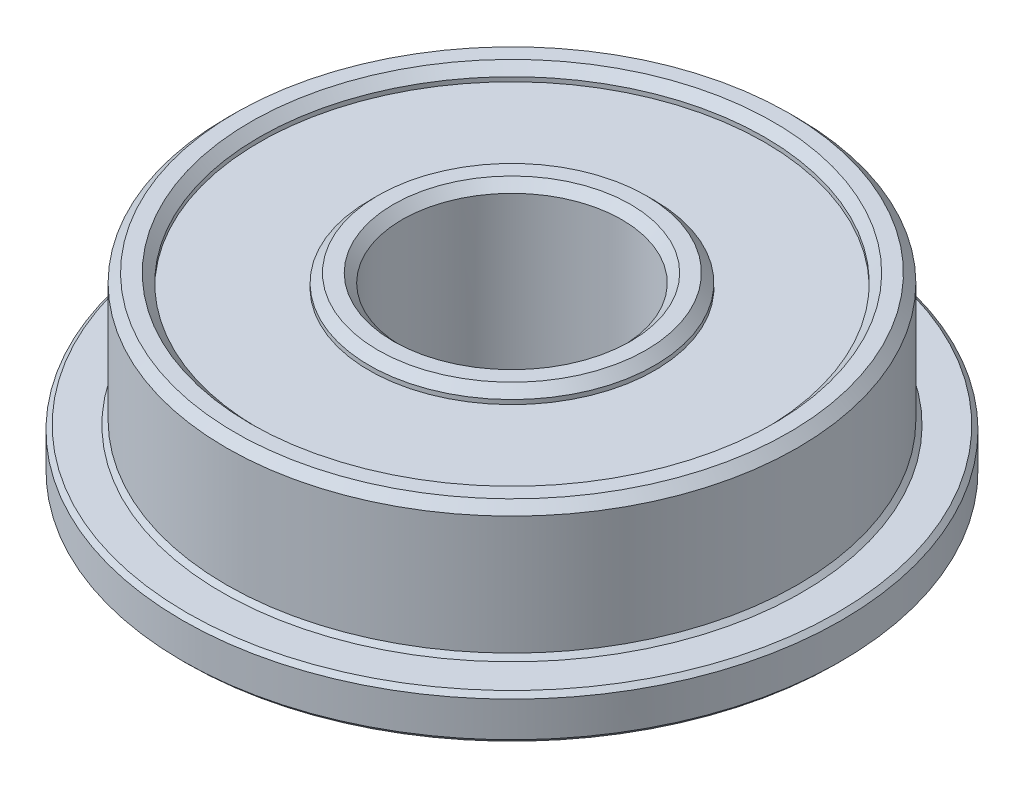
ISO-10303-21;
HEADER;
FILE_DESCRIPTION(('STEP AP214'),'2;1');
FILE_NAME('part.step','',(''),(''),'','','');
FILE_SCHEMA(('AUTOMOTIVE_DESIGN { 1 0 10303 214 1 1 1 1 }'));
ENDSEC;
DATA;
#1=APPLICATION_CONTEXT('core data for automotive mechanical design processes');
#2=APPLICATION_PROTOCOL_DEFINITION('international standard','automotive_design',2000,#1);
#3=PRODUCT_CONTEXT('',#1,'mechanical');
#4=PRODUCT('Part','Part','',(#3));
#5=PRODUCT_RELATED_PRODUCT_CATEGORY('part','',(#4));
#6=PRODUCT_DEFINITION_FORMATION('','',#4);
#7=PRODUCT_DEFINITION_CONTEXT('part definition',#1,'design');
#8=PRODUCT_DEFINITION('design','',#6,#7);
#9=PRODUCT_DEFINITION_SHAPE('','',#8);
#10=(LENGTH_UNIT() NAMED_UNIT(*) SI_UNIT(.MILLI.,.METRE.));
#11=(NAMED_UNIT(*) PLANE_ANGLE_UNIT() SI_UNIT($,.RADIAN.));
#12=(NAMED_UNIT(*) SI_UNIT($,.STERADIAN.) SOLID_ANGLE_UNIT());
#13=UNCERTAINTY_MEASURE_WITH_UNIT(LENGTH_MEASURE(1.E-05),#10,'distance_accuracy_value','');
#14=(GEOMETRIC_REPRESENTATION_CONTEXT(3) GLOBAL_UNCERTAINTY_ASSIGNED_CONTEXT((#13)) GLOBAL_UNIT_ASSIGNED_CONTEXT((#10,
#11,#12)) REPRESENTATION_CONTEXT('',''));
#15=CARTESIAN_POINT('',(0.,0.,0.));
#16=DIRECTION('',(0.,0.,1.));
#17=DIRECTION('',(1.,0.,0.));
#18=AXIS2_PLACEMENT_3D('',#15,#16,#17);
#19=CARTESIAN_POINT('',(0.,0.,0.));
#20=DIRECTION('',(0.,-1.,0.));
#21=DIRECTION('',(0.,0.,-1.));
#22=AXIS2_PLACEMENT_3D('',#19,#20,#21);
#23=CONICAL_SURFACE('',#22,2.69999999994752,0.785398163397448);
#24=CARTESIAN_POINT('',(0.,0.2,0.));
#25=DIRECTION('',(0.,-1.,0.));
#26=DIRECTION('',(0.,0.,-1.));
#27=AXIS2_PLACEMENT_3D('',#24,#25,#26);
#28=CIRCLE('',#27,2.5);
#29=CARTESIAN_POINT('',(0.,0.200000000000001,-2.5));
#30=VERTEX_POINT('',#29);
#31=EDGE_CURVE('E51',#30,#30,#28,.F.);
#32=ORIENTED_EDGE('',*,*,#31,.T.);
#33=EDGE_LOOP('',(#32));
#34=FACE_BOUND('',#33,.T.);
#35=CARTESIAN_POINT('',(0.,0.,0.));
#36=DIRECTION('',(0.,-1.,0.));
#37=DIRECTION('',(0.,0.,-1.));
#38=AXIS2_PLACEMENT_3D('',#35,#36,#37);
#39=CIRCLE('',#38,2.69999999994752);
#40=CARTESIAN_POINT('',(0.,0.,-2.69999999994752));
#41=VERTEX_POINT('',#40);
#42=EDGE_CURVE('E18',#41,#41,#39,.F.);
#43=ORIENTED_EDGE('',*,*,#42,.F.);
#44=EDGE_LOOP('',(#43));
#45=FACE_BOUND('',#44,.T.);
#46=ADVANCED_FACE('F15',(#34,#45),#23,.F.);
#47=CARTESIAN_POINT('',(0.,0.,0.));
#48=DIRECTION('',(0.,-1.,0.));
#49=DIRECTION('',(0.,0.,-1.));
#50=AXIS2_PLACEMENT_3D('',#47,#48,#49);
#51=PLANE('',#50);
#52=ORIENTED_EDGE('',*,*,#42,.T.);
#53=EDGE_LOOP('',(#52));
#54=FACE_BOUND('',#53,.T.);
#55=CARTESIAN_POINT('',(0.,0.,0.));
#56=DIRECTION('',(0.,1.,0.));
#57=DIRECTION('',(0.,0.,1.));
#58=AXIS2_PLACEMENT_3D('',#55,#56,#57);
#59=CIRCLE('',#58,3.5);
#60=CARTESIAN_POINT('',(0.,0.,3.5));
#61=VERTEX_POINT('',#60);
#62=EDGE_CURVE('E54',#61,#61,#59,.T.);
#63=ORIENTED_EDGE('',*,*,#62,.F.);
#64=EDGE_LOOP('',(#63));
#65=FACE_BOUND('',#64,.T.);
#66=ADVANCED_FACE('F93',(#54,#65),#51,.T.);
#67=CARTESIAN_POINT('',(0.,4.,0.));
#68=DIRECTION('',(0.,-1.,0.));
#69=DIRECTION('',(0.,0.,-1.));
#70=AXIS2_PLACEMENT_3D('',#67,#68,#69);
#71=CYLINDRICAL_SURFACE('',#70,2.5);
#72=ORIENTED_EDGE('',*,*,#31,.F.);
#73=EDGE_LOOP('',(#72));
#74=FACE_BOUND('',#73,.T.);
#75=CARTESIAN_POINT('',(0.,3.79999999995562,0.));
#76=DIRECTION('',(0.,1.,0.));
#77=DIRECTION('',(-1.,0.,0.));
#78=AXIS2_PLACEMENT_3D('',#75,#76,#77);
#79=CIRCLE('',#78,2.49999999994088);
#80=CARTESIAN_POINT('',(-2.49999999994088,3.79999999995562,0.));
#81=VERTEX_POINT('',#80);
#82=EDGE_CURVE('E55',#81,#81,#79,.T.);
#83=ORIENTED_EDGE('',*,*,#82,.T.);
#84=EDGE_LOOP('',(#83));
#85=FACE_BOUND('',#84,.T.);
#86=ADVANCED_FACE('F95',(#74,#85),#71,.F.);
#87=CARTESIAN_POINT('',(0.,0.,0.));
#88=DIRECTION('',(0.,1.,0.));
#89=DIRECTION('',(0.,0.,1.));
#90=AXIS2_PLACEMENT_3D('',#87,#88,#89);
#91=CYLINDRICAL_SURFACE('',#90,3.5);
#92=CARTESIAN_POINT('',(0.,0.3,0.));
#93=DIRECTION('',(0.,1.,0.));
#94=DIRECTION('',(0.,0.,1.));
#95=AXIS2_PLACEMENT_3D('',#92,#93,#94);
#96=CIRCLE('',#95,3.5);
#97=CARTESIAN_POINT('',(0.,0.299999999999999,3.5));
#98=VERTEX_POINT('',#97);
#99=EDGE_CURVE('E58',#98,#98,#96,.T.);
#100=ORIENTED_EDGE('',*,*,#99,.F.);
#101=EDGE_LOOP('',(#100));
#102=FACE_BOUND('',#101,.T.);
#103=ORIENTED_EDGE('',*,*,#62,.T.);
#104=EDGE_LOOP('',(#103));
#105=FACE_BOUND('',#104,.T.);
#106=ADVANCED_FACE('F91',(#102,#105),#91,.T.);
#107=CARTESIAN_POINT('',(0.,4.0000000000191,0.));
#108=DIRECTION('',(0.,1.,0.));
#109=DIRECTION('',(0.,0.,1.));
#110=AXIS2_PLACEMENT_3D('',#107,#108,#109);
#111=CONICAL_SURFACE('',#110,2.70000000000437,0.785398163397448);
#112=ORIENTED_EDGE('',*,*,#82,.F.);
#113=EDGE_LOOP('',(#112));
#114=FACE_BOUND('',#113,.T.);
#115=CARTESIAN_POINT('',(0.,4.0000000000191,0.));
#116=DIRECTION('',(0.,1.,0.));
#117=DIRECTION('',(0.,0.,1.));
#118=AXIS2_PLACEMENT_3D('',#115,#116,#117);
#119=CIRCLE('',#118,2.70000000000437);
#120=CARTESIAN_POINT('',(0.,4.0000000000191,2.70000000000437));
#121=VERTEX_POINT('',#120);
#122=EDGE_CURVE('E84',#121,#121,#119,.F.);
#123=ORIENTED_EDGE('',*,*,#122,.F.);
#124=EDGE_LOOP('',(#123));
#125=FACE_BOUND('',#124,.T.);
#126=ADVANCED_FACE('F180',(#114,#125),#111,.F.);
#127=CARTESIAN_POINT('',(0.,0.3,0.));
#128=DIRECTION('',(0.,-1.,0.));
#129=DIRECTION('',(0.,0.,-1.));
#130=AXIS2_PLACEMENT_3D('',#127,#128,#129);
#131=PLANE('',#130);
#132=ORIENTED_EDGE('',*,*,#99,.T.);
#133=EDGE_LOOP('',(#132));
#134=FACE_BOUND('',#133,.T.);
#135=CARTESIAN_POINT('',(0.,0.3,0.));
#136=DIRECTION('',(0.,1.,0.));
#137=DIRECTION('',(0.,0.,1.));
#138=AXIS2_PLACEMENT_3D('',#135,#136,#137);
#139=CIRCLE('',#138,5.75);
#140=CARTESIAN_POINT('',(0.,0.299999999999999,5.75));
#141=VERTEX_POINT('',#140);
#142=EDGE_CURVE('E81',#141,#141,#139,.F.);
#143=ORIENTED_EDGE('',*,*,#142,.T.);
#144=EDGE_LOOP('',(#143));
#145=FACE_BOUND('',#144,.T.);
#146=ADVANCED_FACE('F176',(#134,#145),#131,.T.);
#147=CARTESIAN_POINT('',(0.,4.,0.));
#148=DIRECTION('',(0.,1.,0.));
#149=DIRECTION('',(0.,0.,1.));
#150=AXIS2_PLACEMENT_3D('',#147,#148,#149);
#151=PLANE('',#150);
#152=ORIENTED_EDGE('',*,*,#122,.T.);
#153=EDGE_LOOP('',(#152));
#154=FACE_BOUND('',#153,.T.);
#155=CARTESIAN_POINT('',(0.,3.99999999996226,0.));
#156=DIRECTION('',(0.,-1.,0.));
#157=DIRECTION('',(0.,0.,-1.));
#158=AXIS2_PLACEMENT_3D('',#155,#156,#157);
#159=CIRCLE('',#158,3.0500000000302);
#160=CARTESIAN_POINT('',(0.,3.99999999996226,-3.05000000003019));
#161=VERTEX_POINT('',#160);
#162=EDGE_CURVE('E50',#161,#161,#159,.T.);
#163=ORIENTED_EDGE('',*,*,#162,.F.);
#164=EDGE_LOOP('',(#163));
#165=FACE_BOUND('',#164,.T.);
#166=ADVANCED_FACE('F172',(#154,#165),#151,.T.);
#167=CARTESIAN_POINT('',(0.,0.,0.));
#168=DIRECTION('',(0.,1.,0.));
#169=DIRECTION('',(0.,0.,1.));
#170=AXIS2_PLACEMENT_3D('',#167,#168,#169);
#171=CYLINDRICAL_SURFACE('',#170,5.75);
#172=ORIENTED_EDGE('',*,*,#142,.F.);
#173=EDGE_LOOP('',(#172));
#174=FACE_BOUND('',#173,.T.);
#175=CARTESIAN_POINT('',(0.,0.200000000006639,0.));
#176=DIRECTION('',(0.,-1.,0.));
#177=DIRECTION('',(1.,0.,0.));
#178=AXIS2_PLACEMENT_3D('',#175,#176,#177);
#179=CIRCLE('',#178,5.75000000003456);
#180=CARTESIAN_POINT('',(5.75000000003456,0.200000000006639,0.));
#181=VERTEX_POINT('',#180);
#182=EDGE_CURVE('E47',#181,#181,#179,.T.);
#183=ORIENTED_EDGE('',*,*,#182,.T.);
#184=EDGE_LOOP('',(#183));
#185=FACE_BOUND('',#184,.T.);
#186=ADVANCED_FACE('F168',(#174,#185),#171,.F.);
#187=CARTESIAN_POINT('',(0.,3.80000000001246,0.));
#188=DIRECTION('',(0.,-1.,0.));
#189=DIRECTION('',(0.,0.,-1.));
#190=AXIS2_PLACEMENT_3D('',#187,#188,#189);
#191=CONICAL_SURFACE('',#190,3.24999999997999,0.785398163397448);
#192=CARTESIAN_POINT('',(0.,3.8,0.));
#193=DIRECTION('',(0.,-1.,0.));
#194=DIRECTION('',(0.,0.,-1.));
#195=AXIS2_PLACEMENT_3D('',#192,#193,#194);
#196=CIRCLE('',#195,3.25);
#197=CARTESIAN_POINT('',(0.,3.8,-3.25));
#198=VERTEX_POINT('',#197);
#199=EDGE_CURVE('E43',#198,#198,#196,.T.);
#200=ORIENTED_EDGE('',*,*,#199,.F.);
#201=EDGE_LOOP('',(#200));
#202=FACE_BOUND('',#201,.T.);
#203=ORIENTED_EDGE('',*,*,#162,.T.);
#204=EDGE_LOOP('',(#203));
#205=FACE_BOUND('',#204,.T.);
#206=ADVANCED_FACE('F164',(#202,#205),#191,.T.);
#207=CARTESIAN_POINT('',(0.,5.6843418860808E-11,0.));
#208=DIRECTION('',(0.,-1.,0.));
#209=DIRECTION('',(0.,0.,-1.));
#210=AXIS2_PLACEMENT_3D('',#207,#208,#209);
#211=CONICAL_SURFACE('',#210,5.94999999998436,0.785398163397448);
#212=ORIENTED_EDGE('',*,*,#182,.F.);
#213=EDGE_LOOP('',(#212));
#214=FACE_BOUND('',#213,.T.);
#215=CARTESIAN_POINT('',(0.,0.,0.));
#216=DIRECTION('',(0.,-1.,0.));
#217=DIRECTION('',(0.,0.,-1.));
#218=AXIS2_PLACEMENT_3D('',#215,#216,#217);
#219=CIRCLE('',#218,5.9500000000412);
#220=CARTESIAN_POINT('',(0.,0.,-5.9500000000412));
#221=VERTEX_POINT('',#220);
#222=EDGE_CURVE('E46',#221,#221,#219,.F.);
#223=ORIENTED_EDGE('',*,*,#222,.F.);
#224=EDGE_LOOP('',(#223));
#225=FACE_BOUND('',#224,.T.);
#226=ADVANCED_FACE('F160',(#214,#225),#211,.F.);
#227=CARTESIAN_POINT('',(0.,4.,0.));
#228=DIRECTION('',(0.,-1.,0.));
#229=DIRECTION('',(0.,0.,-1.));
#230=AXIS2_PLACEMENT_3D('',#227,#228,#229);
#231=CYLINDRICAL_SURFACE('',#230,3.25);
#232=CARTESIAN_POINT('',(0.,3.7,0.));
#233=DIRECTION('',(0.,-1.,0.));
#234=DIRECTION('',(0.,0.,-1.));
#235=AXIS2_PLACEMENT_3D('',#232,#233,#234);
#236=CIRCLE('',#235,3.25);
#237=CARTESIAN_POINT('',(0.,3.7,-3.25));
#238=VERTEX_POINT('',#237);
#239=EDGE_CURVE('E74',#238,#238,#236,.T.);
#240=ORIENTED_EDGE('',*,*,#239,.F.);
#241=EDGE_LOOP('',(#240));
#242=FACE_BOUND('',#241,.T.);
#243=ORIENTED_EDGE('',*,*,#199,.T.);
#244=EDGE_LOOP('',(#243));
#245=FACE_BOUND('',#244,.T.);
#246=ADVANCED_FACE('F156',(#242,#245),#231,.T.);
#247=CARTESIAN_POINT('',(0.,0.,0.));
#248=DIRECTION('',(0.,-1.,0.));
#249=DIRECTION('',(0.,0.,-1.));
#250=AXIS2_PLACEMENT_3D('',#247,#248,#249);
#251=PLANE('',#250);
#252=ORIENTED_EDGE('',*,*,#222,.T.);
#253=EDGE_LOOP('',(#252));
#254=FACE_BOUND('',#253,.T.);
#255=CARTESIAN_POINT('',(0.,0.,0.));
#256=DIRECTION('',(0.,1.,0.));
#257=DIRECTION('',(0.,0.,1.));
#258=AXIS2_PLACEMENT_3D('',#255,#256,#257);
#259=CIRCLE('',#258,7.4);
#260=CARTESIAN_POINT('',(0.,0.,7.4));
#261=VERTEX_POINT('',#260);
#262=EDGE_CURVE('E71',#261,#261,#259,.T.);
#263=ORIENTED_EDGE('',*,*,#262,.F.);
#264=EDGE_LOOP('',(#263));
#265=FACE_BOUND('',#264,.T.);
#266=ADVANCED_FACE('F152',(#254,#265),#251,.T.);
#267=CARTESIAN_POINT('',(0.,3.7,0.));
#268=DIRECTION('',(0.,1.,0.));
#269=DIRECTION('',(0.,0.,1.));
#270=AXIS2_PLACEMENT_3D('',#267,#268,#269);
#271=PLANE('',#270);
#272=ORIENTED_EDGE('',*,*,#239,.T.);
#273=EDGE_LOOP('',(#272));
#274=FACE_BOUND('',#273,.T.);
#275=CARTESIAN_POINT('',(0.,3.7,0.));
#276=DIRECTION('',(0.,-1.,0.));
#277=DIRECTION('',(0.,0.,-1.));
#278=AXIS2_PLACEMENT_3D('',#275,#276,#277);
#279=CIRCLE('',#278,5.75);
#280=CARTESIAN_POINT('',(0.,3.7,-5.75));
#281=VERTEX_POINT('',#280);
#282=EDGE_CURVE('E36',#281,#281,#279,.F.);
#283=ORIENTED_EDGE('',*,*,#282,.T.);
#284=EDGE_LOOP('',(#283));
#285=FACE_BOUND('',#284,.T.);
#286=ADVANCED_FACE('F148',(#274,#285),#271,.T.);
#287=CARTESIAN_POINT('',(0.,0.100000000000001,0.));
#288=DIRECTION('',(0.,1.,0.));
#289=DIRECTION('',(0.,0.,1.));
#290=AXIS2_PLACEMENT_3D('',#287,#288,#289);
#291=CONICAL_SURFACE('',#290,7.5,0.785398163397449);
#292=ORIENTED_EDGE('',*,*,#262,.T.);
#293=EDGE_LOOP('',(#292));
#294=FACE_BOUND('',#293,.T.);
#295=CARTESIAN_POINT('',(0.,0.1,0.));
#296=DIRECTION('',(0.,1.,0.));
#297=DIRECTION('',(0.,0.,1.));
#298=AXIS2_PLACEMENT_3D('',#295,#296,#297);
#299=CIRCLE('',#298,7.5);
#300=CARTESIAN_POINT('',(0.,0.1,7.5));
#301=VERTEX_POINT('',#300);
#302=EDGE_CURVE('E32',#301,#301,#299,.T.);
#303=ORIENTED_EDGE('',*,*,#302,.F.);
#304=EDGE_LOOP('',(#303));
#305=FACE_BOUND('',#304,.T.);
#306=ADVANCED_FACE('F144',(#294,#305),#291,.T.);
#307=CARTESIAN_POINT('',(0.,4.,0.));
#308=DIRECTION('',(0.,-1.,0.));
#309=DIRECTION('',(0.,0.,-1.));
#310=AXIS2_PLACEMENT_3D('',#307,#308,#309);
#311=CYLINDRICAL_SURFACE('',#310,5.75);
#312=ORIENTED_EDGE('',*,*,#282,.F.);
#313=EDGE_LOOP('',(#312));
#314=FACE_BOUND('',#313,.T.);
#315=CARTESIAN_POINT('',(0.,3.79999999995562,0.));
#316=DIRECTION('',(0.,1.,0.));
#317=DIRECTION('',(-1.,0.,0.));
#318=AXIS2_PLACEMENT_3D('',#315,#316,#317);
#319=CIRCLE('',#318,5.74999999992087);
#320=CARTESIAN_POINT('',(-5.74999999992087,3.79999999995562,0.));
#321=VERTEX_POINT('',#320);
#322=EDGE_CURVE('E35',#321,#321,#319,.T.);
#323=ORIENTED_EDGE('',*,*,#322,.T.);
#324=EDGE_LOOP('',(#323));
#325=FACE_BOUND('',#324,.T.);
#326=ADVANCED_FACE('F140',(#314,#325),#311,.F.);
#327=CARTESIAN_POINT('',(0.,0.,0.));
#328=DIRECTION('',(0.,1.,0.));
#329=DIRECTION('',(0.,0.,1.));
#330=AXIS2_PLACEMENT_3D('',#327,#328,#329);
#331=CYLINDRICAL_SURFACE('',#330,7.5);
#332=ORIENTED_EDGE('',*,*,#302,.T.);
#333=EDGE_LOOP('',(#332));
#334=FACE_BOUND('',#333,.T.);
#335=CARTESIAN_POINT('',(0.,0.9,0.));
#336=DIRECTION('',(0.,-1.,0.));
#337=DIRECTION('',(1.,0.,0.));
#338=AXIS2_PLACEMENT_3D('',#335,#336,#337);
#339=CIRCLE('',#338,7.5);
#340=CARTESIAN_POINT('',(7.5,0.9,0.));
#341=VERTEX_POINT('',#340);
#342=EDGE_CURVE('E37',#341,#341,#339,.F.);
#343=ORIENTED_EDGE('',*,*,#342,.F.);
#344=EDGE_LOOP('',(#343));
#345=FACE_BOUND('',#344,.T.);
#346=ADVANCED_FACE('F136',(#334,#345),#331,.T.);
#347=CARTESIAN_POINT('',(0.,3.99999999990541,0.));
#348=DIRECTION('',(0.,1.,0.));
#349=DIRECTION('',(0.,0.,1.));
#350=AXIS2_PLACEMENT_3D('',#347,#348,#349);
#351=CONICAL_SURFACE('',#350,5.94999999987067,0.785398163397448);
#352=ORIENTED_EDGE('',*,*,#322,.F.);
#353=EDGE_LOOP('',(#352));
#354=FACE_BOUND('',#353,.T.);
#355=CARTESIAN_POINT('',(0.,3.99999999996226,0.));
#356=DIRECTION('',(0.,1.,0.));
#357=DIRECTION('',(0.,0.,1.));
#358=AXIS2_PLACEMENT_3D('',#355,#356,#357);
#359=CIRCLE('',#358,5.94999999992751);
#360=CARTESIAN_POINT('',(0.,3.99999999996225,5.94999999992751));
#361=VERTEX_POINT('',#360);
#362=EDGE_CURVE('E40',#361,#361,#359,.F.);
#363=ORIENTED_EDGE('',*,*,#362,.F.);
#364=EDGE_LOOP('',(#363));
#365=FACE_BOUND('',#364,.T.);
#366=ADVANCED_FACE('F132',(#354,#365),#351,.F.);
#367=CARTESIAN_POINT('',(0.,0.899999999999999,0.));
#368=DIRECTION('',(0.,-1.,0.));
#369=DIRECTION('',(0.,0.,-1.));
#370=AXIS2_PLACEMENT_3D('',#367,#368,#369);
#371=CONICAL_SURFACE('',#370,7.5,0.785398163397447);
#372=ORIENTED_EDGE('',*,*,#342,.T.);
#373=EDGE_LOOP('',(#372));
#374=FACE_BOUND('',#373,.T.);
#375=CARTESIAN_POINT('',(0.,1.,0.));
#376=DIRECTION('',(0.,-1.,0.));
#377=DIRECTION('',(0.,0.,-1.));
#378=AXIS2_PLACEMENT_3D('',#375,#376,#377);
#379=CIRCLE('',#378,7.4);
#380=CARTESIAN_POINT('',(0.,1.,-7.4));
#381=VERTEX_POINT('',#380);
#382=EDGE_CURVE('E64',#381,#381,#379,.F.);
#383=ORIENTED_EDGE('',*,*,#382,.F.);
#384=EDGE_LOOP('',(#383));
#385=FACE_BOUND('',#384,.T.);
#386=ADVANCED_FACE('F128',(#374,#385),#371,.T.);
#387=CARTESIAN_POINT('',(0.,4.,0.));
#388=DIRECTION('',(0.,1.,0.));
#389=DIRECTION('',(0.,0.,1.));
#390=AXIS2_PLACEMENT_3D('',#387,#388,#389);
#391=PLANE('',#390);
#392=ORIENTED_EDGE('',*,*,#362,.T.);
#393=EDGE_LOOP('',(#392));
#394=FACE_BOUND('',#393,.T.);
#395=CARTESIAN_POINT('',(0.,4.0000000000191,0.));
#396=DIRECTION('',(0.,-1.,0.));
#397=DIRECTION('',(0.,0.,-1.));
#398=AXIS2_PLACEMENT_3D('',#395,#396,#397);
#399=CIRCLE('',#398,6.29999999995334);
#400=CARTESIAN_POINT('',(0.,4.0000000000191,-6.29999999995334));
#401=VERTEX_POINT('',#400);
#402=EDGE_CURVE('E61',#401,#401,#399,.T.);
#403=ORIENTED_EDGE('',*,*,#402,.F.);
#404=EDGE_LOOP('',(#403));
#405=FACE_BOUND('',#404,.T.);
#406=ADVANCED_FACE('F124',(#394,#405),#391,.T.);
#407=CARTESIAN_POINT('',(0.,1.,0.));
#408=DIRECTION('',(0.,1.,0.));
#409=DIRECTION('',(0.,0.,1.));
#410=AXIS2_PLACEMENT_3D('',#407,#408,#409);
#411=PLANE('',#410);
#412=CARTESIAN_POINT('',(0.,1.0000000000332,0.));
#413=DIRECTION('',(0.,-1.,0.));
#414=DIRECTION('',(0.,0.,-1.));
#415=AXIS2_PLACEMENT_3D('',#412,#413,#414);
#416=CIRCLE('',#415,6.59999999999172);
#417=CARTESIAN_POINT('',(0.,1.0000000000332,-6.59999999999172));
#418=VERTEX_POINT('',#417);
#419=EDGE_CURVE('E27',#418,#418,#416,.F.);
#420=ORIENTED_EDGE('',*,*,#419,.F.);
#421=EDGE_LOOP('',(#420));
#422=FACE_BOUND('',#421,.T.);
#423=ORIENTED_EDGE('',*,*,#382,.T.);
#424=EDGE_LOOP('',(#423));
#425=FACE_BOUND('',#424,.T.);
#426=ADVANCED_FACE('F120',(#422,#425),#411,.T.);
#427=CARTESIAN_POINT('',(0.,3.79999999995562,0.));
#428=DIRECTION('',(0.,-1.,0.));
#429=DIRECTION('',(0.,0.,-1.));
#430=AXIS2_PLACEMENT_3D('',#427,#428,#429);
#431=CONICAL_SURFACE('',#430,6.50000000001683,0.785398163397448);
#432=CARTESIAN_POINT('',(0.,3.8,0.));
#433=DIRECTION('',(0.,1.,0.));
#434=DIRECTION('',(0.,0.,1.));
#435=AXIS2_PLACEMENT_3D('',#432,#433,#434);
#436=CIRCLE('',#435,6.5);
#437=CARTESIAN_POINT('',(0.,3.8,6.5));
#438=VERTEX_POINT('',#437);
#439=EDGE_CURVE('E22',#438,#438,#436,.F.);
#440=ORIENTED_EDGE('',*,*,#439,.F.);
#441=EDGE_LOOP('',(#440));
#442=FACE_BOUND('',#441,.T.);
#443=ORIENTED_EDGE('',*,*,#402,.T.);
#444=EDGE_LOOP('',(#443));
#445=FACE_BOUND('',#444,.T.);
#446=ADVANCED_FACE('F113',(#442,#445),#431,.T.);
#447=CARTESIAN_POINT('',(0.,1.0000000000332,0.));
#448=DIRECTION('',(0.,-1.,0.));
#449=DIRECTION('',(0.,0.,-1.));
#450=AXIS2_PLACEMENT_3D('',#447,#448,#449);
#451=CONICAL_SURFACE('',#450,6.59999999999172,0.785398163397448);
#452=ORIENTED_EDGE('',*,*,#419,.T.);
#453=EDGE_LOOP('',(#452));
#454=FACE_BOUND('',#453,.T.);
#455=CARTESIAN_POINT('',(0.,1.1,0.));
#456=DIRECTION('',(0.,1.,0.));
#457=DIRECTION('',(0.,0.,1.));
#458=AXIS2_PLACEMENT_3D('',#455,#456,#457);
#459=CIRCLE('',#458,6.5);
#460=CARTESIAN_POINT('',(0.,1.1,6.5));
#461=VERTEX_POINT('',#460);
#462=EDGE_CURVE('E10',#461,#461,#459,.T.);
#463=ORIENTED_EDGE('',*,*,#462,.F.);
#464=EDGE_LOOP('',(#463));
#465=FACE_BOUND('',#464,.T.);
#466=ADVANCED_FACE('F108',(#454,#465),#451,.T.);
#467=CARTESIAN_POINT('',(0.,2.,0.));
#468=DIRECTION('',(0.,1.,0.));
#469=DIRECTION('',(0.,0.,1.));
#470=AXIS2_PLACEMENT_3D('',#467,#468,#469);
#471=CYLINDRICAL_SURFACE('',#470,6.5);
#472=ORIENTED_EDGE('',*,*,#462,.T.);
#473=EDGE_LOOP('',(#472));
#474=FACE_BOUND('',#473,.T.);
#475=ORIENTED_EDGE('',*,*,#439,.T.);
#476=EDGE_LOOP('',(#475));
#477=FACE_BOUND('',#476,.T.);
#478=ADVANCED_FACE('F106',(#474,#477),#471,.T.);
#479=CLOSED_SHELL('',(#46,#66,#86,#106,#126,#146,#166,#186,#206,#226,#246,#266,#286,#306,#326,
#346,#366,#386,#406,#426,#446,#466,#478));
#480=MANIFOLD_SOLID_BREP('B1',#479);
#481=ADVANCED_BREP_SHAPE_REPRESENTATION('',(#18,#480),#14);
#482=SHAPE_DEFINITION_REPRESENTATION(#9,#481);
ENDSEC;
END-ISO-10303-21;
